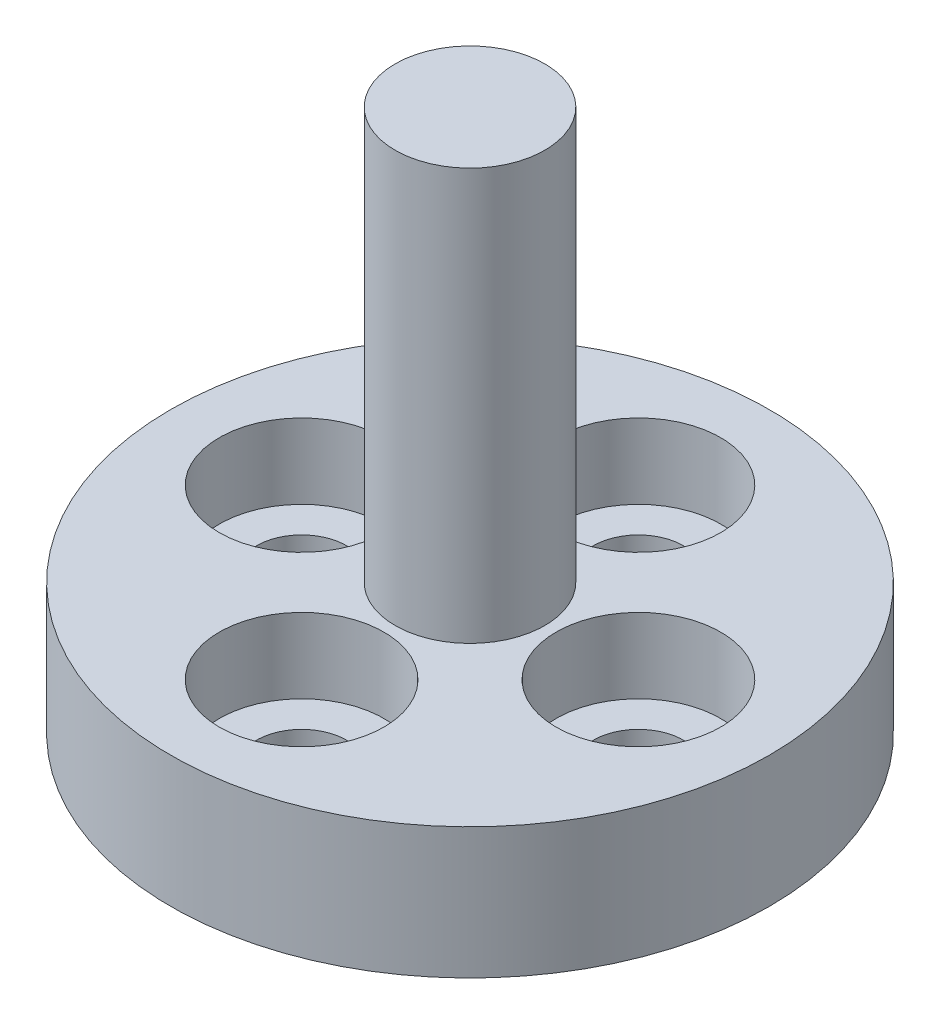
ISO-10303-21;
HEADER;
FILE_DESCRIPTION(('STEP AP214'),'2;1');
FILE_NAME('part.step','',(''),(''),'','','');
FILE_SCHEMA(('AUTOMOTIVE_DESIGN { 1 0 10303 214 1 1 1 1 }'));
ENDSEC;
DATA;
#1=APPLICATION_CONTEXT('core data for automotive mechanical design processes');
#2=APPLICATION_PROTOCOL_DEFINITION('international standard','automotive_design',2000,#1);
#3=PRODUCT_CONTEXT('',#1,'mechanical');
#4=PRODUCT('Part','Part','',(#3));
#5=PRODUCT_RELATED_PRODUCT_CATEGORY('part','',(#4));
#6=PRODUCT_DEFINITION_FORMATION('','',#4);
#7=PRODUCT_DEFINITION_CONTEXT('part definition',#1,'design');
#8=PRODUCT_DEFINITION('design','',#6,#7);
#9=PRODUCT_DEFINITION_SHAPE('','',#8);
#10=(LENGTH_UNIT() NAMED_UNIT(*) SI_UNIT(.MILLI.,.METRE.));
#11=(NAMED_UNIT(*) PLANE_ANGLE_UNIT() SI_UNIT($,.RADIAN.));
#12=(NAMED_UNIT(*) SI_UNIT($,.STERADIAN.) SOLID_ANGLE_UNIT());
#13=UNCERTAINTY_MEASURE_WITH_UNIT(LENGTH_MEASURE(1.E-05),#10,'distance_accuracy_value','');
#14=(GEOMETRIC_REPRESENTATION_CONTEXT(3) GLOBAL_UNCERTAINTY_ASSIGNED_CONTEXT((#13)) GLOBAL_UNIT_ASSIGNED_CONTEXT((#10,
#11,#12)) REPRESENTATION_CONTEXT('',''));
#15=CARTESIAN_POINT('',(0.,0.,0.));
#16=DIRECTION('',(0.,0.,1.));
#17=DIRECTION('',(1.,0.,0.));
#18=AXIS2_PLACEMENT_3D('',#15,#16,#17);
#19=CARTESIAN_POINT('',(8.,3.5,0.));
#20=DIRECTION('',(0.,-1.,0.));
#21=DIRECTION('',(1.,0.,0.));
#22=AXIS2_PLACEMENT_3D('',#19,#20,#21);
#23=PLANE('',#22);
#24=CARTESIAN_POINT('',(-4.5,3.5,0.));
#25=DIRECTION('',(0.,1.,0.));
#26=DIRECTION('',(0.,0.,1.));
#27=AXIS2_PLACEMENT_3D('',#24,#25,#26);
#28=CIRCLE('',#27,2.2);
#29=CARTESIAN_POINT('',(-4.5,3.5,2.2));
#30=VERTEX_POINT('',#29);
#31=EDGE_CURVE('E121',#30,#30,#28,.T.);
#32=ORIENTED_EDGE('',*,*,#31,.F.);
#33=EDGE_LOOP('',(#32));
#34=FACE_BOUND('',#33,.T.);
#35=CARTESIAN_POINT('',(0.,3.5,-4.5));
#36=DIRECTION('',(0.,1.,0.));
#37=DIRECTION('',(0.,0.,1.));
#38=AXIS2_PLACEMENT_3D('',#35,#36,#37);
#39=CIRCLE('',#38,2.2);
#40=CARTESIAN_POINT('',(0.,3.5,-2.3));
#41=VERTEX_POINT('',#40);
#42=EDGE_CURVE('E105',#41,#41,#39,.T.);
#43=ORIENTED_EDGE('',*,*,#42,.F.);
#44=EDGE_LOOP('',(#43));
#45=FACE_BOUND('',#44,.T.);
#46=CARTESIAN_POINT('',(4.5,3.5,0.));
#47=DIRECTION('',(0.,1.,0.));
#48=DIRECTION('',(0.,0.,1.));
#49=AXIS2_PLACEMENT_3D('',#46,#47,#48);
#50=CIRCLE('',#49,2.2);
#51=CARTESIAN_POINT('',(4.5,3.5,2.2));
#52=VERTEX_POINT('',#51);
#53=EDGE_CURVE('E89',#52,#52,#50,.T.);
#54=ORIENTED_EDGE('',*,*,#53,.F.);
#55=EDGE_LOOP('',(#54));
#56=FACE_BOUND('',#55,.T.);
#57=CARTESIAN_POINT('',(0.,3.5,0.));
#58=DIRECTION('',(0.,1.,0.));
#59=DIRECTION('',(-1.,0.,0.));
#60=AXIS2_PLACEMENT_3D('',#57,#58,#59);
#61=CIRCLE('',#60,2.);
#62=CARTESIAN_POINT('',(-2.,3.5,0.));
#63=VERTEX_POINT('',#62);
#64=EDGE_CURVE('E50',#63,#63,#61,.T.);
#65=ORIENTED_EDGE('',*,*,#64,.F.);
#66=EDGE_LOOP('',(#65));
#67=FACE_BOUND('',#66,.T.);
#68=CARTESIAN_POINT('',(0.,3.5,0.));
#69=DIRECTION('',(0.,1.,0.));
#70=DIRECTION('',(-1.,0.,0.));
#71=AXIS2_PLACEMENT_3D('',#68,#69,#70);
#72=CIRCLE('',#71,8.);
#73=CARTESIAN_POINT('',(-8.,3.5,0.));
#74=VERTEX_POINT('',#73);
#75=EDGE_CURVE('E45',#74,#74,#72,.T.);
#76=ORIENTED_EDGE('',*,*,#75,.T.);
#77=EDGE_LOOP('',(#76));
#78=FACE_BOUND('',#77,.T.);
#79=CARTESIAN_POINT('',(0.,3.5,4.5));
#80=DIRECTION('',(0.,1.,0.));
#81=DIRECTION('',(0.,0.,1.));
#82=AXIS2_PLACEMENT_3D('',#79,#80,#81);
#83=CIRCLE('',#82,2.2);
#84=CARTESIAN_POINT('',(0.,3.5,6.7));
#85=VERTEX_POINT('',#84);
#86=EDGE_CURVE('E73',#85,#85,#83,.T.);
#87=ORIENTED_EDGE('',*,*,#86,.F.);
#88=EDGE_LOOP('',(#87));
#89=FACE_BOUND('',#88,.T.);
#90=ADVANCED_FACE('F37',(#34,#45,#56,#67,#78,#89),#23,.F.);
#91=CARTESIAN_POINT('',(0.,0.,0.));
#92=DIRECTION('',(0.,1.,0.));
#93=DIRECTION('',(-1.,0.,0.));
#94=AXIS2_PLACEMENT_3D('',#91,#92,#93);
#95=PLANE('',#94);
#96=CARTESIAN_POINT('',(-4.5,0.,0.));
#97=DIRECTION('',(0.,1.,0.));
#98=DIRECTION('',(0.,0.,1.));
#99=AXIS2_PLACEMENT_3D('',#96,#97,#98);
#100=CIRCLE('',#99,1.2);
#101=CARTESIAN_POINT('',(-4.5,0.,1.2));
#102=VERTEX_POINT('',#101);
#103=EDGE_CURVE('E109',#102,#102,#100,.T.);
#104=ORIENTED_EDGE('',*,*,#103,.T.);
#105=EDGE_LOOP('',(#104));
#106=FACE_BOUND('',#105,.T.);
#107=CARTESIAN_POINT('',(0.,0.,-4.5));
#108=DIRECTION('',(0.,1.,0.));
#109=DIRECTION('',(0.,0.,1.));
#110=AXIS2_PLACEMENT_3D('',#107,#108,#109);
#111=CIRCLE('',#110,1.2);
#112=CARTESIAN_POINT('',(0.,0.,-3.3));
#113=VERTEX_POINT('',#112);
#114=EDGE_CURVE('E93',#113,#113,#111,.T.);
#115=ORIENTED_EDGE('',*,*,#114,.T.);
#116=EDGE_LOOP('',(#115));
#117=FACE_BOUND('',#116,.T.);
#118=CARTESIAN_POINT('',(4.5,0.,0.));
#119=DIRECTION('',(0.,1.,0.));
#120=DIRECTION('',(0.,0.,1.));
#121=AXIS2_PLACEMENT_3D('',#118,#119,#120);
#122=CIRCLE('',#121,1.2);
#123=CARTESIAN_POINT('',(4.5,0.,1.2));
#124=VERTEX_POINT('',#123);
#125=EDGE_CURVE('E77',#124,#124,#122,.T.);
#126=ORIENTED_EDGE('',*,*,#125,.T.);
#127=EDGE_LOOP('',(#126));
#128=FACE_BOUND('',#127,.T.);
#129=CARTESIAN_POINT('',(0.,0.,4.5));
#130=DIRECTION('',(0.,1.,0.));
#131=DIRECTION('',(0.,0.,1.));
#132=AXIS2_PLACEMENT_3D('',#129,#130,#131);
#133=CIRCLE('',#132,1.2);
#134=CARTESIAN_POINT('',(0.,0.,5.7));
#135=VERTEX_POINT('',#134);
#136=EDGE_CURVE('E61',#135,#135,#133,.T.);
#137=ORIENTED_EDGE('',*,*,#136,.T.);
#138=EDGE_LOOP('',(#137));
#139=FACE_BOUND('',#138,.T.);
#140=CARTESIAN_POINT('',(0.,0.,0.));
#141=DIRECTION('',(0.,1.,0.));
#142=DIRECTION('',(-1.,0.,0.));
#143=AXIS2_PLACEMENT_3D('',#140,#141,#142);
#144=CIRCLE('',#143,8.);
#145=CARTESIAN_POINT('',(-8.,0.,0.));
#146=VERTEX_POINT('',#145);
#147=EDGE_CURVE('E10',#146,#146,#144,.T.);
#148=ORIENTED_EDGE('',*,*,#147,.F.);
#149=EDGE_LOOP('',(#148));
#150=FACE_BOUND('',#149,.T.);
#151=ADVANCED_FACE('F39',(#106,#117,#128,#139,#150),#95,.F.);
#152=CARTESIAN_POINT('',(0.,14.5,0.));
#153=DIRECTION('',(0.,1.,0.));
#154=DIRECTION('',(-1.,0.,0.));
#155=AXIS2_PLACEMENT_3D('',#152,#153,#154);
#156=CYLINDRICAL_SURFACE('',#155,8.);
#157=ORIENTED_EDGE('',*,*,#75,.F.);
#158=EDGE_LOOP('',(#157));
#159=FACE_BOUND('',#158,.T.);
#160=ORIENTED_EDGE('',*,*,#147,.T.);
#161=EDGE_LOOP('',(#160));
#162=FACE_BOUND('',#161,.T.);
#163=ADVANCED_FACE('F167',(#159,#162),#156,.T.);
#164=CARTESIAN_POINT('',(0.,14.5,0.));
#165=DIRECTION('',(0.,1.,0.));
#166=DIRECTION('',(-1.,0.,0.));
#167=AXIS2_PLACEMENT_3D('',#164,#165,#166);
#168=CYLINDRICAL_SURFACE('',#167,2.);
#169=CARTESIAN_POINT('',(0.,14.5,0.));
#170=DIRECTION('',(0.,1.,0.));
#171=DIRECTION('',(-1.,0.,0.));
#172=AXIS2_PLACEMENT_3D('',#169,#170,#171);
#173=CIRCLE('',#172,2.);
#174=CARTESIAN_POINT('',(-2.,14.5,0.));
#175=VERTEX_POINT('',#174);
#176=EDGE_CURVE('E55',#175,#175,#173,.T.);
#177=ORIENTED_EDGE('',*,*,#176,.F.);
#178=EDGE_LOOP('',(#177));
#179=FACE_BOUND('',#178,.T.);
#180=ORIENTED_EDGE('',*,*,#64,.T.);
#181=EDGE_LOOP('',(#180));
#182=FACE_BOUND('',#181,.T.);
#183=ADVANCED_FACE('F164',(#179,#182),#168,.T.);
#184=CARTESIAN_POINT('',(2.,14.5,0.));
#185=DIRECTION('',(0.,-1.,0.));
#186=DIRECTION('',(1.,0.,0.));
#187=AXIS2_PLACEMENT_3D('',#184,#185,#186);
#188=PLANE('',#187);
#189=ORIENTED_EDGE('',*,*,#176,.T.);
#190=EDGE_LOOP('',(#189));
#191=FACE_BOUND('',#190,.T.);
#192=ADVANCED_FACE('F160',(#191),#188,.F.);
#193=CARTESIAN_POINT('',(0.,3.5,4.5));
#194=DIRECTION('',(0.,1.,0.));
#195=DIRECTION('',(0.,0.,1.));
#196=AXIS2_PLACEMENT_3D('',#193,#194,#195);
#197=CYLINDRICAL_SURFACE('',#196,1.2);
#198=ORIENTED_EDGE('',*,*,#136,.F.);
#199=EDGE_LOOP('',(#198));
#200=FACE_BOUND('',#199,.T.);
#201=CARTESIAN_POINT('',(0.,1.5,4.5));
#202=DIRECTION('',(0.,1.,0.));
#203=DIRECTION('',(0.,0.,1.));
#204=AXIS2_PLACEMENT_3D('',#201,#202,#203);
#205=CIRCLE('',#204,1.2);
#206=CARTESIAN_POINT('',(0.,1.5,5.7));
#207=VERTEX_POINT('',#206);
#208=EDGE_CURVE('E65',#207,#207,#205,.T.);
#209=ORIENTED_EDGE('',*,*,#208,.T.);
#210=EDGE_LOOP('',(#209));
#211=FACE_BOUND('',#210,.T.);
#212=ADVANCED_FACE('F152',(#200,#211),#197,.F.);
#213=CARTESIAN_POINT('',(1.2,1.5,4.5));
#214=DIRECTION('',(0.,-1.,0.));
#215=DIRECTION('',(0.,0.,-1.));
#216=AXIS2_PLACEMENT_3D('',#213,#214,#215);
#217=PLANE('',#216);
#218=ORIENTED_EDGE('',*,*,#208,.F.);
#219=EDGE_LOOP('',(#218));
#220=FACE_BOUND('',#219,.T.);
#221=CARTESIAN_POINT('',(0.,1.5,4.5));
#222=DIRECTION('',(0.,1.,0.));
#223=DIRECTION('',(0.,0.,1.));
#224=AXIS2_PLACEMENT_3D('',#221,#222,#223);
#225=CIRCLE('',#224,2.2);
#226=CARTESIAN_POINT('',(0.,1.5,6.7));
#227=VERTEX_POINT('',#226);
#228=EDGE_CURVE('E69',#227,#227,#225,.T.);
#229=ORIENTED_EDGE('',*,*,#228,.T.);
#230=EDGE_LOOP('',(#229));
#231=FACE_BOUND('',#230,.T.);
#232=ADVANCED_FACE('F142',(#220,#231),#217,.F.);
#233=CARTESIAN_POINT('',(0.,3.5,4.5));
#234=DIRECTION('',(0.,1.,0.));
#235=DIRECTION('',(0.,0.,1.));
#236=AXIS2_PLACEMENT_3D('',#233,#234,#235);
#237=CYLINDRICAL_SURFACE('',#236,2.2);
#238=ORIENTED_EDGE('',*,*,#228,.F.);
#239=EDGE_LOOP('',(#238));
#240=FACE_BOUND('',#239,.T.);
#241=ORIENTED_EDGE('',*,*,#86,.T.);
#242=EDGE_LOOP('',(#241));
#243=FACE_BOUND('',#242,.T.);
#244=ADVANCED_FACE('F139',(#240,#243),#237,.F.);
#245=CARTESIAN_POINT('',(4.5,3.5,0.));
#246=DIRECTION('',(0.,1.,0.));
#247=DIRECTION('',(0.,0.,1.));
#248=AXIS2_PLACEMENT_3D('',#245,#246,#247);
#249=CYLINDRICAL_SURFACE('',#248,1.2);
#250=ORIENTED_EDGE('',*,*,#125,.F.);
#251=EDGE_LOOP('',(#250));
#252=FACE_BOUND('',#251,.T.);
#253=CARTESIAN_POINT('',(4.5,1.5,0.));
#254=DIRECTION('',(0.,1.,0.));
#255=DIRECTION('',(0.,0.,1.));
#256=AXIS2_PLACEMENT_3D('',#253,#254,#255);
#257=CIRCLE('',#256,1.2);
#258=CARTESIAN_POINT('',(4.5,1.5,1.2));
#259=VERTEX_POINT('',#258);
#260=EDGE_CURVE('E81',#259,#259,#257,.T.);
#261=ORIENTED_EDGE('',*,*,#260,.T.);
#262=EDGE_LOOP('',(#261));
#263=FACE_BOUND('',#262,.T.);
#264=ADVANCED_FACE('F141',(#252,#263),#249,.F.);
#265=CARTESIAN_POINT('',(5.7,1.5,0.));
#266=DIRECTION('',(0.,-1.,0.));
#267=DIRECTION('',(0.,0.,-1.));
#268=AXIS2_PLACEMENT_3D('',#265,#266,#267);
#269=PLANE('',#268);
#270=ORIENTED_EDGE('',*,*,#260,.F.);
#271=EDGE_LOOP('',(#270));
#272=FACE_BOUND('',#271,.T.);
#273=CARTESIAN_POINT('',(4.5,1.5,0.));
#274=DIRECTION('',(0.,1.,0.));
#275=DIRECTION('',(0.,0.,1.));
#276=AXIS2_PLACEMENT_3D('',#273,#274,#275);
#277=CIRCLE('',#276,2.2);
#278=CARTESIAN_POINT('',(4.5,1.5,2.2));
#279=VERTEX_POINT('',#278);
#280=EDGE_CURVE('E85',#279,#279,#277,.T.);
#281=ORIENTED_EDGE('',*,*,#280,.T.);
#282=EDGE_LOOP('',(#281));
#283=FACE_BOUND('',#282,.T.);
#284=ADVANCED_FACE('F149',(#272,#283),#269,.F.);
#285=CARTESIAN_POINT('',(4.5,3.5,0.));
#286=DIRECTION('',(0.,1.,0.));
#287=DIRECTION('',(0.,0.,1.));
#288=AXIS2_PLACEMENT_3D('',#285,#286,#287);
#289=CYLINDRICAL_SURFACE('',#288,2.2);
#290=ORIENTED_EDGE('',*,*,#280,.F.);
#291=EDGE_LOOP('',(#290));
#292=FACE_BOUND('',#291,.T.);
#293=ORIENTED_EDGE('',*,*,#53,.T.);
#294=EDGE_LOOP('',(#293));
#295=FACE_BOUND('',#294,.T.);
#296=ADVANCED_FACE('F193',(#292,#295),#289,.F.);
#297=CARTESIAN_POINT('',(0.,3.5,-4.5));
#298=DIRECTION('',(0.,1.,0.));
#299=DIRECTION('',(0.,0.,1.));
#300=AXIS2_PLACEMENT_3D('',#297,#298,#299);
#301=CYLINDRICAL_SURFACE('',#300,1.2);
#302=ORIENTED_EDGE('',*,*,#114,.F.);
#303=EDGE_LOOP('',(#302));
#304=FACE_BOUND('',#303,.T.);
#305=CARTESIAN_POINT('',(0.,1.5,-4.5));
#306=DIRECTION('',(0.,1.,0.));
#307=DIRECTION('',(0.,0.,1.));
#308=AXIS2_PLACEMENT_3D('',#305,#306,#307);
#309=CIRCLE('',#308,1.2);
#310=CARTESIAN_POINT('',(0.,1.5,-3.3));
#311=VERTEX_POINT('',#310);
#312=EDGE_CURVE('E97',#311,#311,#309,.T.);
#313=ORIENTED_EDGE('',*,*,#312,.T.);
#314=EDGE_LOOP('',(#313));
#315=FACE_BOUND('',#314,.T.);
#316=ADVANCED_FACE('F198',(#304,#315),#301,.F.);
#317=CARTESIAN_POINT('',(1.2,1.5,-4.5));
#318=DIRECTION('',(0.,-1.,0.));
#319=DIRECTION('',(0.,0.,-1.));
#320=AXIS2_PLACEMENT_3D('',#317,#318,#319);
#321=PLANE('',#320);
#322=ORIENTED_EDGE('',*,*,#312,.F.);
#323=EDGE_LOOP('',(#322));
#324=FACE_BOUND('',#323,.T.);
#325=CARTESIAN_POINT('',(0.,1.5,-4.5));
#326=DIRECTION('',(0.,1.,0.));
#327=DIRECTION('',(0.,0.,1.));
#328=AXIS2_PLACEMENT_3D('',#325,#326,#327);
#329=CIRCLE('',#328,2.2);
#330=CARTESIAN_POINT('',(0.,1.5,-2.3));
#331=VERTEX_POINT('',#330);
#332=EDGE_CURVE('E101',#331,#331,#329,.T.);
#333=ORIENTED_EDGE('',*,*,#332,.T.);
#334=EDGE_LOOP('',(#333));
#335=FACE_BOUND('',#334,.T.);
#336=ADVANCED_FACE('F203',(#324,#335),#321,.F.);
#337=CARTESIAN_POINT('',(0.,3.5,-4.5));
#338=DIRECTION('',(0.,1.,0.));
#339=DIRECTION('',(0.,0.,1.));
#340=AXIS2_PLACEMENT_3D('',#337,#338,#339);
#341=CYLINDRICAL_SURFACE('',#340,2.2);
#342=ORIENTED_EDGE('',*,*,#332,.F.);
#343=EDGE_LOOP('',(#342));
#344=FACE_BOUND('',#343,.T.);
#345=ORIENTED_EDGE('',*,*,#42,.T.);
#346=EDGE_LOOP('',(#345));
#347=FACE_BOUND('',#346,.T.);
#348=ADVANCED_FACE('F209',(#344,#347),#341,.F.);
#349=CARTESIAN_POINT('',(-4.5,3.5,0.));
#350=DIRECTION('',(0.,1.,0.));
#351=DIRECTION('',(0.,0.,1.));
#352=AXIS2_PLACEMENT_3D('',#349,#350,#351);
#353=CYLINDRICAL_SURFACE('',#352,1.2);
#354=ORIENTED_EDGE('',*,*,#103,.F.);
#355=EDGE_LOOP('',(#354));
#356=FACE_BOUND('',#355,.T.);
#357=CARTESIAN_POINT('',(-4.5,1.5,0.));
#358=DIRECTION('',(0.,1.,0.));
#359=DIRECTION('',(0.,0.,1.));
#360=AXIS2_PLACEMENT_3D('',#357,#358,#359);
#361=CIRCLE('',#360,1.2);
#362=CARTESIAN_POINT('',(-4.5,1.5,1.2));
#363=VERTEX_POINT('',#362);
#364=EDGE_CURVE('E113',#363,#363,#361,.T.);
#365=ORIENTED_EDGE('',*,*,#364,.T.);
#366=EDGE_LOOP('',(#365));
#367=FACE_BOUND('',#366,.T.);
#368=ADVANCED_FACE('F213',(#356,#367),#353,.F.);
#369=CARTESIAN_POINT('',(-3.3,1.5,0.));
#370=DIRECTION('',(0.,-1.,0.));
#371=DIRECTION('',(0.,0.,-1.));
#372=AXIS2_PLACEMENT_3D('',#369,#370,#371);
#373=PLANE('',#372);
#374=ORIENTED_EDGE('',*,*,#364,.F.);
#375=EDGE_LOOP('',(#374));
#376=FACE_BOUND('',#375,.T.);
#377=CARTESIAN_POINT('',(-4.5,1.5,0.));
#378=DIRECTION('',(0.,1.,0.));
#379=DIRECTION('',(0.,0.,1.));
#380=AXIS2_PLACEMENT_3D('',#377,#378,#379);
#381=CIRCLE('',#380,2.2);
#382=CARTESIAN_POINT('',(-4.5,1.5,2.2));
#383=VERTEX_POINT('',#382);
#384=EDGE_CURVE('E117',#383,#383,#381,.T.);
#385=ORIENTED_EDGE('',*,*,#384,.T.);
#386=EDGE_LOOP('',(#385));
#387=FACE_BOUND('',#386,.T.);
#388=ADVANCED_FACE('F217',(#376,#387),#373,.F.);
#389=CARTESIAN_POINT('',(-4.5,3.5,0.));
#390=DIRECTION('',(0.,1.,0.));
#391=DIRECTION('',(0.,0.,1.));
#392=AXIS2_PLACEMENT_3D('',#389,#390,#391);
#393=CYLINDRICAL_SURFACE('',#392,2.2);
#394=ORIENTED_EDGE('',*,*,#384,.F.);
#395=EDGE_LOOP('',(#394));
#396=FACE_BOUND('',#395,.T.);
#397=ORIENTED_EDGE('',*,*,#31,.T.);
#398=EDGE_LOOP('',(#397));
#399=FACE_BOUND('',#398,.T.);
#400=ADVANCED_FACE('F126',(#396,#399),#393,.F.);
#401=CLOSED_SHELL('',(#90,#151,#163,#183,#192,#212,#232,#244,#264,#284,#296,#316,#336,#348,#368,
#388,#400));
#402=MANIFOLD_SOLID_BREP('B2',#401);
#403=ADVANCED_BREP_SHAPE_REPRESENTATION('',(#18,#402),#14);
#404=SHAPE_DEFINITION_REPRESENTATION(#9,#403);
ENDSEC;
END-ISO-10303-21;
